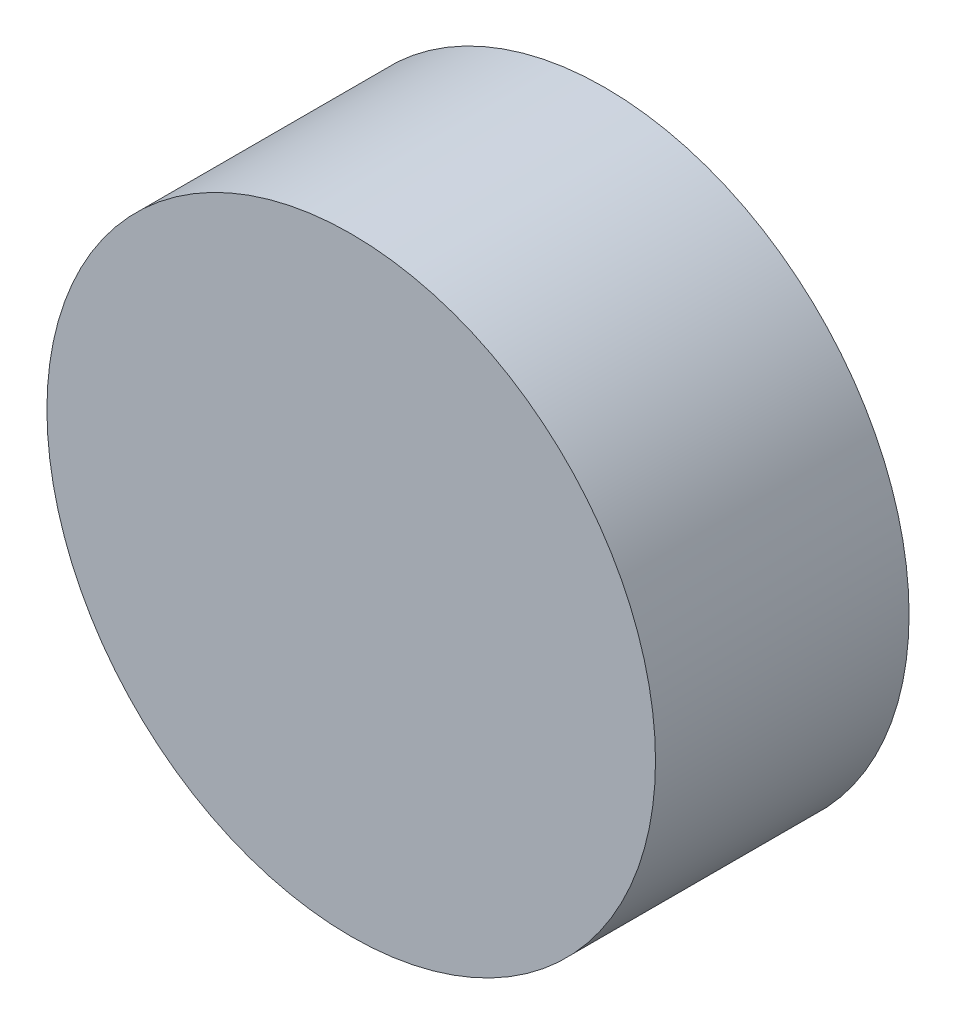
ISO-10303-21;
HEADER;
FILE_DESCRIPTION(('STEP AP214'),'2;1');
FILE_NAME('part.step','',(''),(''),'','','');
FILE_SCHEMA(('AUTOMOTIVE_DESIGN { 1 0 10303 214 1 1 1 1 }'));
ENDSEC;
DATA;
#1=APPLICATION_CONTEXT('core data for automotive mechanical design processes');
#2=APPLICATION_PROTOCOL_DEFINITION('international standard','automotive_design',2000,#1);
#3=PRODUCT_CONTEXT('',#1,'mechanical');
#4=PRODUCT('Part','Part','',(#3));
#5=PRODUCT_RELATED_PRODUCT_CATEGORY('part','',(#4));
#6=PRODUCT_DEFINITION_FORMATION('','',#4);
#7=PRODUCT_DEFINITION_CONTEXT('part definition',#1,'design');
#8=PRODUCT_DEFINITION('design','',#6,#7);
#9=PRODUCT_DEFINITION_SHAPE('','',#8);
#10=(LENGTH_UNIT() NAMED_UNIT(*) SI_UNIT(.MILLI.,.METRE.));
#11=(NAMED_UNIT(*) PLANE_ANGLE_UNIT() SI_UNIT($,.RADIAN.));
#12=(NAMED_UNIT(*) SI_UNIT($,.STERADIAN.) SOLID_ANGLE_UNIT());
#13=UNCERTAINTY_MEASURE_WITH_UNIT(LENGTH_MEASURE(1.E-05),#10,'distance_accuracy_value','');
#14=(GEOMETRIC_REPRESENTATION_CONTEXT(3) GLOBAL_UNCERTAINTY_ASSIGNED_CONTEXT((#13)) GLOBAL_UNIT_ASSIGNED_CONTEXT((#10,
#11,#12)) REPRESENTATION_CONTEXT('',''));
#15=CARTESIAN_POINT('',(0.,0.,0.));
#16=DIRECTION('',(0.,0.,1.));
#17=DIRECTION('',(1.,0.,0.));
#18=AXIS2_PLACEMENT_3D('',#15,#16,#17);
#19=CARTESIAN_POINT('',(0.,0.,2.5));
#20=DIRECTION('',(0.,0.,-1.));
#21=DIRECTION('',(-1.,0.,0.));
#22=AXIS2_PLACEMENT_3D('',#19,#20,#21);
#23=CYLINDRICAL_SURFACE('',#22,3.);
#24=CARTESIAN_POINT('',(0.,0.,2.5));
#25=DIRECTION('',(0.,0.,1.));
#26=DIRECTION('',(1.,0.,0.));
#27=AXIS2_PLACEMENT_3D('',#24,#25,#26);
#28=CIRCLE('',#27,3.);
#29=CARTESIAN_POINT('',(3.,0.,2.5));
#30=VERTEX_POINT('',#29);
#31=EDGE_CURVE('E10',#30,#30,#28,.T.);
#32=ORIENTED_EDGE('',*,*,#31,.F.);
#33=EDGE_LOOP('',(#32));
#34=FACE_BOUND('',#33,.T.);
#35=CARTESIAN_POINT('',(0.,0.,0.));
#36=DIRECTION('',(0.,0.,1.));
#37=DIRECTION('',(1.,0.,0.));
#38=AXIS2_PLACEMENT_3D('',#35,#36,#37);
#39=CIRCLE('',#38,3.);
#40=CARTESIAN_POINT('',(3.,0.,0.));
#41=VERTEX_POINT('',#40);
#42=EDGE_CURVE('E33',#41,#41,#39,.T.);
#43=ORIENTED_EDGE('',*,*,#42,.T.);
#44=EDGE_LOOP('',(#43));
#45=FACE_BOUND('',#44,.T.);
#46=ADVANCED_FACE('F30',(#34,#45),#23,.T.);
#47=CARTESIAN_POINT('',(0.,0.,2.5));
#48=DIRECTION('',(0.,0.,1.));
#49=DIRECTION('',(1.,0.,0.));
#50=AXIS2_PLACEMENT_3D('',#47,#48,#49);
#51=PLANE('',#50);
#52=ORIENTED_EDGE('',*,*,#31,.T.);
#53=EDGE_LOOP('',(#52));
#54=FACE_BOUND('',#53,.T.);
#55=ADVANCED_FACE('F45',(#54),#51,.T.);
#56=CARTESIAN_POINT('',(0.,0.,0.));
#57=DIRECTION('',(0.,0.,1.));
#58=DIRECTION('',(1.,0.,0.));
#59=AXIS2_PLACEMENT_3D('',#56,#57,#58);
#60=PLANE('',#59);
#61=ORIENTED_EDGE('',*,*,#42,.F.);
#62=EDGE_LOOP('',(#61));
#63=FACE_BOUND('',#62,.T.);
#64=ADVANCED_FACE('F43',(#63),#60,.F.);
#65=CLOSED_SHELL('',(#46,#55,#64));
#66=MANIFOLD_SOLID_BREP('B2',#65);
#67=ADVANCED_BREP_SHAPE_REPRESENTATION('',(#18,#66),#14);
#68=SHAPE_DEFINITION_REPRESENTATION(#9,#67);
ENDSEC;
END-ISO-10303-21;
